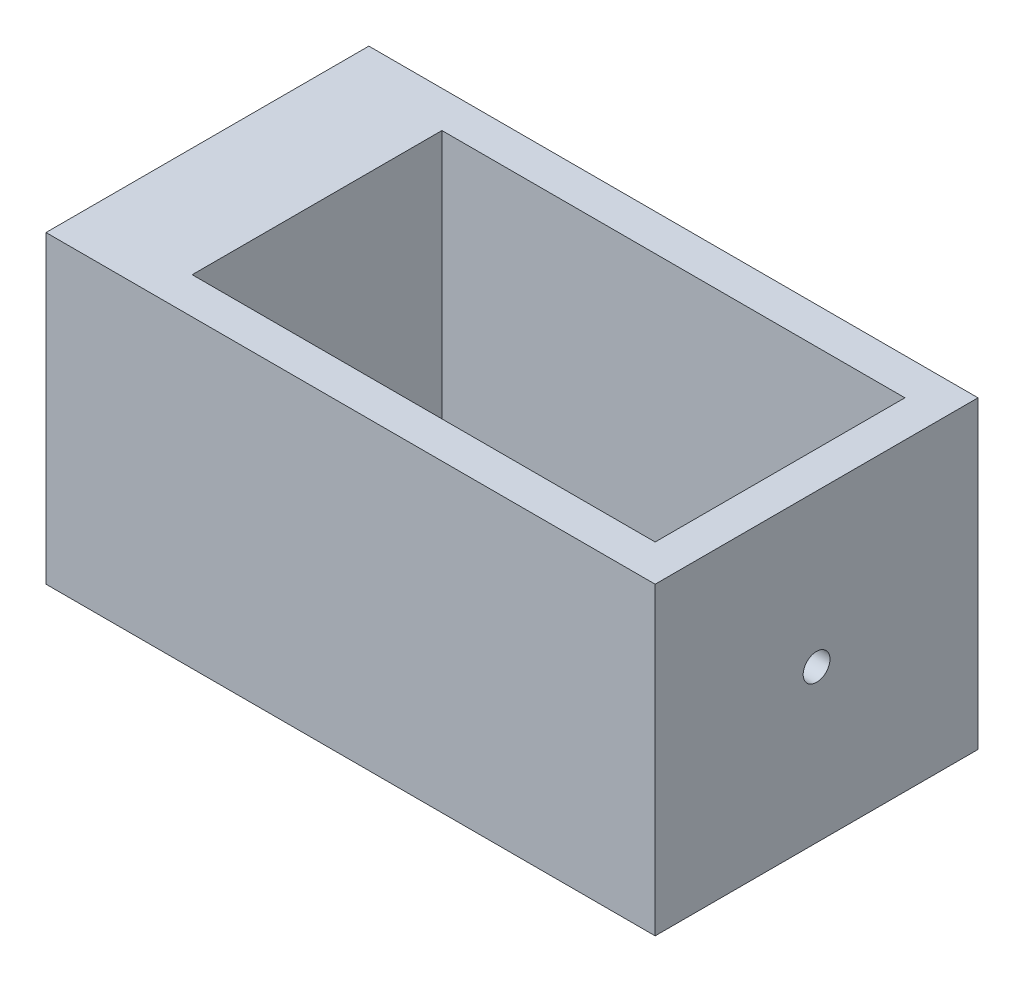
ISO-10303-21;
HEADER;
FILE_DESCRIPTION(('STEP AP214'),'2;1');
FILE_NAME('part.step','',(''),(''),'','','');
FILE_SCHEMA(('AUTOMOTIVE_DESIGN { 1 0 10303 214 1 1 1 1 }'));
ENDSEC;
DATA;
#1=APPLICATION_CONTEXT('core data for automotive mechanical design processes');
#2=APPLICATION_PROTOCOL_DEFINITION('international standard','automotive_design',2000,#1);
#3=PRODUCT_CONTEXT('',#1,'mechanical');
#4=PRODUCT('Part','Part','',(#3));
#5=PRODUCT_RELATED_PRODUCT_CATEGORY('part','',(#4));
#6=PRODUCT_DEFINITION_FORMATION('','',#4);
#7=PRODUCT_DEFINITION_CONTEXT('part definition',#1,'design');
#8=PRODUCT_DEFINITION('design','',#6,#7);
#9=PRODUCT_DEFINITION_SHAPE('','',#8);
#10=(LENGTH_UNIT() NAMED_UNIT(*) SI_UNIT(.MILLI.,.METRE.));
#11=(NAMED_UNIT(*) PLANE_ANGLE_UNIT() SI_UNIT($,.RADIAN.));
#12=(NAMED_UNIT(*) SI_UNIT($,.STERADIAN.) SOLID_ANGLE_UNIT());
#13=UNCERTAINTY_MEASURE_WITH_UNIT(LENGTH_MEASURE(1.E-05),#10,'distance_accuracy_value','');
#14=(GEOMETRIC_REPRESENTATION_CONTEXT(3) GLOBAL_UNCERTAINTY_ASSIGNED_CONTEXT((#13)) GLOBAL_UNIT_ASSIGNED_CONTEXT((#10,
#11,#12)) REPRESENTATION_CONTEXT('',''));
#15=CARTESIAN_POINT('',(0.,0.,0.));
#16=DIRECTION('',(0.,0.,1.));
#17=DIRECTION('',(1.,0.,0.));
#18=AXIS2_PLACEMENT_3D('',#15,#16,#17);
#19=CARTESIAN_POINT('',(0.,50.,0.));
#20=DIRECTION('',(0.,-1.,0.));
#21=DIRECTION('',(0.,0.,-1.));
#22=AXIS2_PLACEMENT_3D('',#19,#20,#21);
#23=PLANE('',#22);
#24=DIRECTION('',(1.,0.,0.));
#25=VECTOR('',#24,1.);
#26=CARTESIAN_POINT('',(-56.,50.,26.5));
#27=LINE('',#26,#25);
#28=CARTESIAN_POINT('',(-56.,50.,26.5));
#29=VERTEX_POINT('',#28);
#30=CARTESIAN_POINT('',(44.,50.,26.5));
#31=VERTEX_POINT('',#30);
#32=EDGE_CURVE('E138',#29,#31,#27,.T.);
#33=ORIENTED_EDGE('',*,*,#32,.T.);
#34=DIRECTION('',(0.,0.,-1.));
#35=VECTOR('',#34,1.);
#36=CARTESIAN_POINT('',(44.,50.,-26.5));
#37=LINE('',#36,#35);
#38=CARTESIAN_POINT('',(44.,50.,-26.5));
#39=VERTEX_POINT('',#38);
#40=EDGE_CURVE('E140',#31,#39,#37,.T.);
#41=ORIENTED_EDGE('',*,*,#40,.T.);
#42=DIRECTION('',(-1.,0.,0.));
#43=VECTOR('',#42,1.);
#44=CARTESIAN_POINT('',(-38.,50.,-26.5));
#45=LINE('',#44,#43);
#46=CARTESIAN_POINT('',(-56.,50.,-26.5));
#47=VERTEX_POINT('',#46);
#48=EDGE_CURVE('E143',#39,#47,#45,.T.);
#49=ORIENTED_EDGE('',*,*,#48,.T.);
#50=DIRECTION('',(0.,0.,1.));
#51=VECTOR('',#50,1.);
#52=CARTESIAN_POINT('',(-56.,50.,-26.5));
#53=LINE('',#52,#51);
#54=EDGE_CURVE('E145',#47,#29,#53,.T.);
#55=ORIENTED_EDGE('',*,*,#54,.T.);
#56=EDGE_LOOP('',(#33,#41,#49,#55));
#57=FACE_BOUND('',#56,.T.);
#58=DIRECTION('',(0.,0.,-1.));
#59=VECTOR('',#58,1.);
#60=CARTESIAN_POINT('',(38.,50.,-20.5));
#61=LINE('',#60,#59);
#62=CARTESIAN_POINT('',(38.,50.,20.5));
#63=VERTEX_POINT('',#62);
#64=CARTESIAN_POINT('',(38.,50.,-20.5));
#65=VERTEX_POINT('',#64);
#66=EDGE_CURVE('E100',#63,#65,#61,.T.);
#67=ORIENTED_EDGE('',*,*,#66,.F.);
#68=DIRECTION('',(1.,0.,0.));
#69=VECTOR('',#68,1.);
#70=CARTESIAN_POINT('',(-38.,50.,20.5));
#71=LINE('',#70,#69);
#72=CARTESIAN_POINT('',(-38.,50.,20.5));
#73=VERTEX_POINT('',#72);
#74=EDGE_CURVE('E122',#73,#63,#71,.T.);
#75=ORIENTED_EDGE('',*,*,#74,.F.);
#76=DIRECTION('',(0.,0.,1.));
#77=VECTOR('',#76,1.);
#78=CARTESIAN_POINT('',(-38.,50.,-20.5));
#79=LINE('',#78,#77);
#80=CARTESIAN_POINT('',(-38.,50.,-20.5));
#81=VERTEX_POINT('',#80);
#82=EDGE_CURVE('E120',#81,#73,#79,.T.);
#83=ORIENTED_EDGE('',*,*,#82,.F.);
#84=DIRECTION('',(-1.,0.,0.));
#85=VECTOR('',#84,1.);
#86=CARTESIAN_POINT('',(-38.,50.,-20.5));
#87=LINE('',#86,#85);
#88=EDGE_CURVE('E108',#65,#81,#87,.T.);
#89=ORIENTED_EDGE('',*,*,#88,.F.);
#90=EDGE_LOOP('',(#67,#75,#83,#89));
#91=FACE_BOUND('',#90,.T.);
#92=ADVANCED_FACE('F35',(#57,#91),#23,.F.);
#93=CARTESIAN_POINT('',(0.,0.,0.));
#94=DIRECTION('',(0.,-1.,0.));
#95=DIRECTION('',(0.,0.,-1.));
#96=AXIS2_PLACEMENT_3D('',#93,#94,#95);
#97=PLANE('',#96);
#98=DIRECTION('',(1.,0.,0.));
#99=VECTOR('',#98,1.);
#100=CARTESIAN_POINT('',(-38.,0.,26.5));
#101=LINE('',#100,#99);
#102=CARTESIAN_POINT('',(-56.,0.,26.5));
#103=VERTEX_POINT('',#102);
#104=CARTESIAN_POINT('',(44.,0.,26.5));
#105=VERTEX_POINT('',#104);
#106=EDGE_CURVE('E116',#103,#105,#101,.T.);
#107=ORIENTED_EDGE('',*,*,#106,.F.);
#108=DIRECTION('',(0.,0.,1.));
#109=VECTOR('',#108,1.);
#110=CARTESIAN_POINT('',(-56.,0.,-26.5));
#111=LINE('',#110,#109);
#112=CARTESIAN_POINT('',(-56.,0.,-26.5));
#113=VERTEX_POINT('',#112);
#114=EDGE_CURVE('E141',#113,#103,#111,.T.);
#115=ORIENTED_EDGE('',*,*,#114,.F.);
#116=DIRECTION('',(-1.,0.,0.));
#117=VECTOR('',#116,1.);
#118=CARTESIAN_POINT('',(-56.,0.,-26.5));
#119=LINE('',#118,#117);
#120=CARTESIAN_POINT('',(44.,0.,-26.5));
#121=VERTEX_POINT('',#120);
#122=EDGE_CURVE('E152',#121,#113,#119,.T.);
#123=ORIENTED_EDGE('',*,*,#122,.F.);
#124=DIRECTION('',(0.,0.,-1.));
#125=VECTOR('',#124,1.);
#126=CARTESIAN_POINT('',(44.,0.,-26.5));
#127=LINE('',#126,#125);
#128=EDGE_CURVE('E149',#105,#121,#127,.T.);
#129=ORIENTED_EDGE('',*,*,#128,.F.);
#130=EDGE_LOOP('',(#107,#115,#123,#129));
#131=FACE_BOUND('',#130,.T.);
#132=DIRECTION('',(1.,0.,0.));
#133=VECTOR('',#132,1.);
#134=CARTESIAN_POINT('',(-38.,0.,20.5));
#135=LINE('',#134,#133);
#136=CARTESIAN_POINT('',(-38.,0.,20.5));
#137=VERTEX_POINT('',#136);
#138=CARTESIAN_POINT('',(38.,0.,20.5));
#139=VERTEX_POINT('',#138);
#140=EDGE_CURVE('E109',#137,#139,#135,.T.);
#141=ORIENTED_EDGE('',*,*,#140,.T.);
#142=DIRECTION('',(0.,0.,-1.));
#143=VECTOR('',#142,1.);
#144=CARTESIAN_POINT('',(38.,0.,-20.5));
#145=LINE('',#144,#143);
#146=CARTESIAN_POINT('',(38.,0.,-20.5));
#147=VERTEX_POINT('',#146);
#148=EDGE_CURVE('E58',#139,#147,#145,.T.);
#149=ORIENTED_EDGE('',*,*,#148,.T.);
#150=DIRECTION('',(-1.,0.,0.));
#151=VECTOR('',#150,1.);
#152=CARTESIAN_POINT('',(-38.,0.,-20.5));
#153=LINE('',#152,#151);
#154=CARTESIAN_POINT('',(-38.,0.,-20.5));
#155=VERTEX_POINT('',#154);
#156=EDGE_CURVE('E115',#147,#155,#153,.T.);
#157=ORIENTED_EDGE('',*,*,#156,.T.);
#158=DIRECTION('',(0.,0.,1.));
#159=VECTOR('',#158,1.);
#160=CARTESIAN_POINT('',(-38.,0.,-20.5));
#161=LINE('',#160,#159);
#162=EDGE_CURVE('E130',#155,#137,#161,.T.);
#163=ORIENTED_EDGE('',*,*,#162,.T.);
#164=EDGE_LOOP('',(#141,#149,#157,#163));
#165=FACE_BOUND('',#164,.T.);
#166=ADVANCED_FACE('F172',(#131,#165),#97,.T.);
#167=CARTESIAN_POINT('',(-38.,50.,26.5));
#168=DIRECTION('',(0.,0.,-1.));
#169=DIRECTION('',(-1.,0.,0.));
#170=AXIS2_PLACEMENT_3D('',#167,#168,#169);
#171=PLANE('',#170);
#172=ORIENTED_EDGE('',*,*,#106,.T.);
#173=DIRECTION('',(0.,-1.,0.));
#174=VECTOR('',#173,1.);
#175=CARTESIAN_POINT('',(44.,50.,26.5));
#176=LINE('',#175,#174);
#177=EDGE_CURVE('E11',#31,#105,#176,.T.);
#178=ORIENTED_EDGE('',*,*,#177,.F.);
#179=ORIENTED_EDGE('',*,*,#32,.F.);
#180=DIRECTION('',(0.,-1.,0.));
#181=VECTOR('',#180,1.);
#182=CARTESIAN_POINT('',(-56.,50.,26.5));
#183=LINE('',#182,#181);
#184=EDGE_CURVE('E147',#29,#103,#183,.T.);
#185=ORIENTED_EDGE('',*,*,#184,.T.);
#186=EDGE_LOOP('',(#172,#178,#179,#185));
#187=FACE_BOUND('',#186,.T.);
#188=ADVANCED_FACE('F37',(#187),#171,.F.);
#189=CARTESIAN_POINT('',(44.,50.,-26.5));
#190=DIRECTION('',(-1.,0.,0.));
#191=DIRECTION('',(0.,0.,1.));
#192=AXIS2_PLACEMENT_3D('',#189,#190,#191);
#193=PLANE('',#192);
#194=CARTESIAN_POINT('',(44.,25.,0.));
#195=DIRECTION('',(1.,0.,0.));
#196=DIRECTION('',(0.,0.,-1.));
#197=AXIS2_PLACEMENT_3D('',#194,#195,#196);
#198=CIRCLE('',#197,2.2);
#199=CARTESIAN_POINT('',(44.,25.,-2.2));
#200=VERTEX_POINT('',#199);
#201=EDGE_CURVE('E128',#200,#200,#198,.T.);
#202=ORIENTED_EDGE('',*,*,#201,.F.);
#203=EDGE_LOOP('',(#202));
#204=FACE_BOUND('',#203,.T.);
#205=ORIENTED_EDGE('',*,*,#128,.T.);
#206=DIRECTION('',(0.,-1.,0.));
#207=VECTOR('',#206,1.);
#208=CARTESIAN_POINT('',(44.,50.,-26.5));
#209=LINE('',#208,#207);
#210=EDGE_CURVE('E43',#39,#121,#209,.T.);
#211=ORIENTED_EDGE('',*,*,#210,.F.);
#212=ORIENTED_EDGE('',*,*,#40,.F.);
#213=ORIENTED_EDGE('',*,*,#177,.T.);
#214=EDGE_LOOP('',(#205,#211,#212,#213));
#215=FACE_BOUND('',#214,.T.);
#216=ADVANCED_FACE('F168',(#204,#215),#193,.F.);
#217=CARTESIAN_POINT('',(-56.,50.,-26.5));
#218=DIRECTION('',(0.,0.,1.));
#219=DIRECTION('',(1.,0.,0.));
#220=AXIS2_PLACEMENT_3D('',#217,#218,#219);
#221=PLANE('',#220);
#222=ORIENTED_EDGE('',*,*,#122,.T.);
#223=DIRECTION('',(0.,-1.,0.));
#224=VECTOR('',#223,1.);
#225=CARTESIAN_POINT('',(-56.,50.,-26.5));
#226=LINE('',#225,#224);
#227=EDGE_CURVE('E158',#47,#113,#226,.T.);
#228=ORIENTED_EDGE('',*,*,#227,.F.);
#229=ORIENTED_EDGE('',*,*,#48,.F.);
#230=ORIENTED_EDGE('',*,*,#210,.T.);
#231=EDGE_LOOP('',(#222,#228,#229,#230));
#232=FACE_BOUND('',#231,.T.);
#233=ADVANCED_FACE('F164',(#232),#221,.F.);
#234=CARTESIAN_POINT('',(-56.,50.,-26.5));
#235=DIRECTION('',(1.,0.,0.));
#236=DIRECTION('',(0.,0.,-1.));
#237=AXIS2_PLACEMENT_3D('',#234,#235,#236);
#238=PLANE('',#237);
#239=ORIENTED_EDGE('',*,*,#114,.T.);
#240=ORIENTED_EDGE('',*,*,#184,.F.);
#241=ORIENTED_EDGE('',*,*,#54,.F.);
#242=ORIENTED_EDGE('',*,*,#227,.T.);
#243=EDGE_LOOP('',(#239,#240,#241,#242));
#244=FACE_BOUND('',#243,.T.);
#245=ADVANCED_FACE('F177',(#244),#238,.F.);
#246=CARTESIAN_POINT('',(38.,50.,-20.5));
#247=DIRECTION('',(-1.,0.,0.));
#248=DIRECTION('',(0.,0.,1.));
#249=AXIS2_PLACEMENT_3D('',#246,#247,#248);
#250=PLANE('',#249);
#251=CARTESIAN_POINT('',(38.,25.,0.));
#252=DIRECTION('',(-1.,0.,0.));
#253=DIRECTION('',(0.,0.,1.));
#254=AXIS2_PLACEMENT_3D('',#251,#252,#253);
#255=CIRCLE('',#254,2.2);
#256=CARTESIAN_POINT('',(38.,25.,2.2));
#257=VERTEX_POINT('',#256);
#258=EDGE_CURVE('E202',#257,#257,#255,.F.);
#259=ORIENTED_EDGE('',*,*,#258,.T.);
#260=EDGE_LOOP('',(#259));
#261=FACE_BOUND('',#260,.T.);
#262=ORIENTED_EDGE('',*,*,#148,.F.);
#263=DIRECTION('',(0.,-1.,0.));
#264=VECTOR('',#263,1.);
#265=CARTESIAN_POINT('',(38.,50.,20.5));
#266=LINE('',#265,#264);
#267=EDGE_CURVE('E104',#63,#139,#266,.T.);
#268=ORIENTED_EDGE('',*,*,#267,.F.);
#269=ORIENTED_EDGE('',*,*,#66,.T.);
#270=DIRECTION('',(0.,-1.,0.));
#271=VECTOR('',#270,1.);
#272=CARTESIAN_POINT('',(38.,50.,-20.5));
#273=LINE('',#272,#271);
#274=EDGE_CURVE('E103',#65,#147,#273,.T.);
#275=ORIENTED_EDGE('',*,*,#274,.T.);
#276=EDGE_LOOP('',(#262,#268,#269,#275));
#277=FACE_BOUND('',#276,.T.);
#278=ADVANCED_FACE('F102',(#261,#277),#250,.T.);
#279=CARTESIAN_POINT('',(-38.,50.,-20.5));
#280=DIRECTION('',(0.,0.,1.));
#281=DIRECTION('',(1.,0.,0.));
#282=AXIS2_PLACEMENT_3D('',#279,#280,#281);
#283=PLANE('',#282);
#284=ORIENTED_EDGE('',*,*,#156,.F.);
#285=ORIENTED_EDGE('',*,*,#274,.F.);
#286=ORIENTED_EDGE('',*,*,#88,.T.);
#287=DIRECTION('',(0.,-1.,0.));
#288=VECTOR('',#287,1.);
#289=CARTESIAN_POINT('',(-38.,50.,-20.5));
#290=LINE('',#289,#288);
#291=EDGE_CURVE('E117',#81,#155,#290,.T.);
#292=ORIENTED_EDGE('',*,*,#291,.T.);
#293=EDGE_LOOP('',(#284,#285,#286,#292));
#294=FACE_BOUND('',#293,.T.);
#295=ADVANCED_FACE('F112',(#294),#283,.T.);
#296=CARTESIAN_POINT('',(-38.,50.,-20.5));
#297=DIRECTION('',(1.,0.,0.));
#298=DIRECTION('',(0.,0.,-1.));
#299=AXIS2_PLACEMENT_3D('',#296,#297,#298);
#300=PLANE('',#299);
#301=ORIENTED_EDGE('',*,*,#162,.F.);
#302=ORIENTED_EDGE('',*,*,#291,.F.);
#303=ORIENTED_EDGE('',*,*,#82,.T.);
#304=DIRECTION('',(0.,-1.,0.));
#305=VECTOR('',#304,1.);
#306=CARTESIAN_POINT('',(-38.,50.,20.5));
#307=LINE('',#306,#305);
#308=EDGE_CURVE('E50',#73,#137,#307,.T.);
#309=ORIENTED_EDGE('',*,*,#308,.T.);
#310=EDGE_LOOP('',(#301,#302,#303,#309));
#311=FACE_BOUND('',#310,.T.);
#312=ADVANCED_FACE('F215',(#311),#300,.T.);
#313=CARTESIAN_POINT('',(-38.,50.,20.5));
#314=DIRECTION('',(0.,0.,-1.));
#315=DIRECTION('',(-1.,0.,0.));
#316=AXIS2_PLACEMENT_3D('',#313,#314,#315);
#317=PLANE('',#316);
#318=ORIENTED_EDGE('',*,*,#140,.F.);
#319=ORIENTED_EDGE('',*,*,#308,.F.);
#320=ORIENTED_EDGE('',*,*,#74,.T.);
#321=ORIENTED_EDGE('',*,*,#267,.T.);
#322=EDGE_LOOP('',(#318,#319,#320,#321));
#323=FACE_BOUND('',#322,.T.);
#324=ADVANCED_FACE('F210',(#323),#317,.T.);
#325=CARTESIAN_POINT('',(-56.001,25.,0.));
#326=DIRECTION('',(1.,0.,0.));
#327=DIRECTION('',(0.,0.,-1.));
#328=AXIS2_PLACEMENT_3D('',#325,#326,#327);
#329=CYLINDRICAL_SURFACE('',#328,2.2);
#330=ORIENTED_EDGE('',*,*,#258,.F.);
#331=EDGE_LOOP('',(#330));
#332=FACE_BOUND('',#331,.T.);
#333=ORIENTED_EDGE('',*,*,#201,.T.);
#334=EDGE_LOOP('',(#333));
#335=FACE_BOUND('',#334,.T.);
#336=ADVANCED_FACE('F208',(#332,#335),#329,.F.);
#337=CLOSED_SHELL('',(#92,#166,#188,#216,#233,#245,#278,#295,#312,#324,#336));
#338=MANIFOLD_SOLID_BREP('B2',#337);
#339=ADVANCED_BREP_SHAPE_REPRESENTATION('',(#18,#338),#14);
#340=SHAPE_DEFINITION_REPRESENTATION(#9,#339);
ENDSEC;
END-ISO-10303-21;
